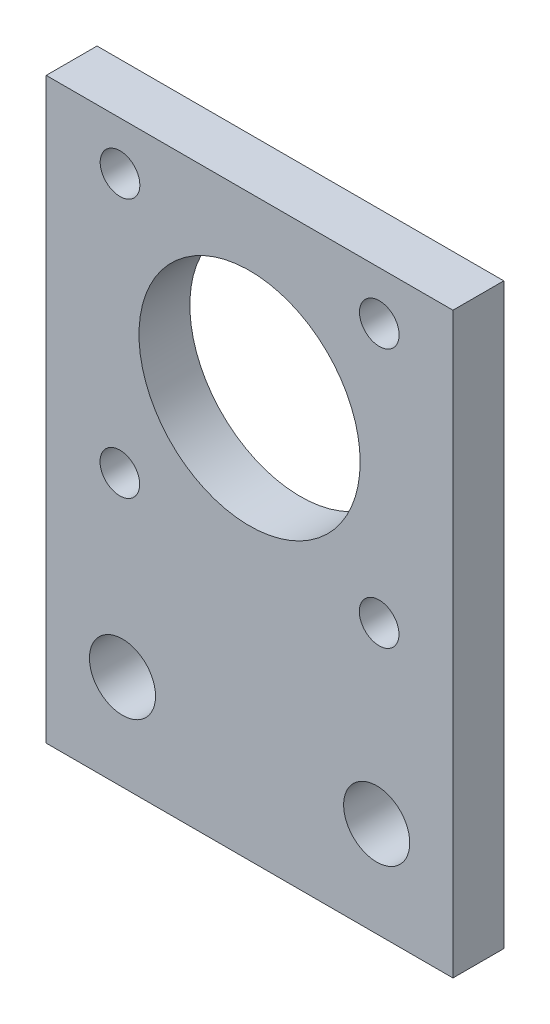
ISO-10303-21;
HEADER;
FILE_DESCRIPTION(('STEP AP214'),'2;1');
FILE_NAME('part.step','',(''),(''),'','','');
FILE_SCHEMA(('AUTOMOTIVE_DESIGN { 1 0 10303 214 1 1 1 1 }'));
ENDSEC;
DATA;
#1=APPLICATION_CONTEXT('core data for automotive mechanical design processes');
#2=APPLICATION_PROTOCOL_DEFINITION('international standard','automotive_design',2000,#1);
#3=PRODUCT_CONTEXT('',#1,'mechanical');
#4=PRODUCT('Part','Part','',(#3));
#5=PRODUCT_RELATED_PRODUCT_CATEGORY('part','',(#4));
#6=PRODUCT_DEFINITION_FORMATION('','',#4);
#7=PRODUCT_DEFINITION_CONTEXT('part definition',#1,'design');
#8=PRODUCT_DEFINITION('design','',#6,#7);
#9=PRODUCT_DEFINITION_SHAPE('','',#8);
#10=(LENGTH_UNIT() NAMED_UNIT(*) SI_UNIT(.MILLI.,.METRE.));
#11=(NAMED_UNIT(*) PLANE_ANGLE_UNIT() SI_UNIT($,.RADIAN.));
#12=(NAMED_UNIT(*) SI_UNIT($,.STERADIAN.) SOLID_ANGLE_UNIT());
#13=UNCERTAINTY_MEASURE_WITH_UNIT(LENGTH_MEASURE(1.E-05),#10,'distance_accuracy_value','');
#14=(GEOMETRIC_REPRESENTATION_CONTEXT(3) GLOBAL_UNCERTAINTY_ASSIGNED_CONTEXT((#13)) GLOBAL_UNIT_ASSIGNED_CONTEXT((#10,
#11,#12)) REPRESENTATION_CONTEXT('',''));
#15=CARTESIAN_POINT('',(0.,0.,0.));
#16=DIRECTION('',(0.,0.,1.));
#17=DIRECTION('',(1.,0.,0.));
#18=AXIS2_PLACEMENT_3D('',#15,#16,#17);
#19=CARTESIAN_POINT('',(25.7883827104955,0.,5.08));
#20=DIRECTION('',(1.,0.,0.));
#21=DIRECTION('',(0.,0.,-1.));
#22=AXIS2_PLACEMENT_3D('',#19,#20,#21);
#23=PLANE('',#22);
#24=DIRECTION('',(0.,-1.,0.));
#25=VECTOR('',#24,1.);
#26=CARTESIAN_POINT('',(25.7883827104955,0.,0.));
#27=LINE('',#26,#25);
#28=CARTESIAN_POINT('',(25.7883827104955,28.4998315016311,0.));
#29=VERTEX_POINT('',#28);
#30=CARTESIAN_POINT('',(25.7883827104955,-29.2851684983689,0.));
#31=VERTEX_POINT('',#30);
#32=EDGE_CURVE('E127',#29,#31,#27,.T.);
#33=ORIENTED_EDGE('',*,*,#32,.F.);
#34=DIRECTION('',(0.,0.,-1.));
#35=VECTOR('',#34,1.);
#36=CARTESIAN_POINT('',(25.7883827104955,28.4998315016311,5.08));
#37=LINE('',#36,#35);
#38=CARTESIAN_POINT('',(25.7883827104955,28.4998315016311,5.08));
#39=VERTEX_POINT('',#38);
#40=EDGE_CURVE('E11',#39,#29,#37,.T.);
#41=ORIENTED_EDGE('',*,*,#40,.F.);
#42=DIRECTION('',(0.,-1.,0.));
#43=VECTOR('',#42,1.);
#44=CARTESIAN_POINT('',(25.7883827104955,0.,5.08));
#45=LINE('',#44,#43);
#46=CARTESIAN_POINT('',(25.7883827104955,-29.2851684983689,5.08));
#47=VERTEX_POINT('',#46);
#48=EDGE_CURVE('E99',#39,#47,#45,.T.);
#49=ORIENTED_EDGE('',*,*,#48,.T.);
#50=DIRECTION('',(0.,0.,-1.));
#51=VECTOR('',#50,1.);
#52=CARTESIAN_POINT('',(25.7883827104955,-29.2851684983689,5.08));
#53=LINE('',#52,#51);
#54=EDGE_CURVE('E77',#47,#31,#53,.T.);
#55=ORIENTED_EDGE('',*,*,#54,.T.);
#56=EDGE_LOOP('',(#33,#41,#49,#55));
#57=FACE_BOUND('',#56,.T.);
#58=ADVANCED_FACE('F37',(#57),#23,.T.);
#59=CARTESIAN_POINT('',(0.,28.4998315016311,5.08));
#60=DIRECTION('',(0.,1.,0.));
#61=DIRECTION('',(0.,0.,1.));
#62=AXIS2_PLACEMENT_3D('',#59,#60,#61);
#63=PLANE('',#62);
#64=DIRECTION('',(1.,0.,0.));
#65=VECTOR('',#64,1.);
#66=CARTESIAN_POINT('',(0.,28.4998315016311,0.));
#67=LINE('',#66,#65);
#68=CARTESIAN_POINT('',(-14.8516172895046,28.4998315016311,0.));
#69=VERTEX_POINT('',#68);
#70=EDGE_CURVE('E89',#69,#29,#67,.T.);
#71=ORIENTED_EDGE('',*,*,#70,.F.);
#72=DIRECTION('',(0.,0.,-1.));
#73=VECTOR('',#72,1.);
#74=CARTESIAN_POINT('',(-14.8516172895046,28.4998315016311,5.08));
#75=LINE('',#74,#73);
#76=CARTESIAN_POINT('',(-14.8516172895046,28.4998315016311,5.08));
#77=VERTEX_POINT('',#76);
#78=EDGE_CURVE('E46',#77,#69,#75,.T.);
#79=ORIENTED_EDGE('',*,*,#78,.F.);
#80=DIRECTION('',(1.,0.,0.));
#81=VECTOR('',#80,1.);
#82=CARTESIAN_POINT('',(0.,28.4998315016311,5.08));
#83=LINE('',#82,#81);
#84=EDGE_CURVE('E87',#77,#39,#83,.T.);
#85=ORIENTED_EDGE('',*,*,#84,.T.);
#86=ORIENTED_EDGE('',*,*,#40,.T.);
#87=EDGE_LOOP('',(#71,#79,#85,#86));
#88=FACE_BOUND('',#87,.T.);
#89=ADVANCED_FACE('F85',(#88),#63,.T.);
#90=CARTESIAN_POINT('',(-14.8516172895046,0.,5.08));
#91=DIRECTION('',(1.,0.,0.));
#92=DIRECTION('',(0.,1.,0.));
#93=AXIS2_PLACEMENT_3D('',#90,#91,#92);
#94=PLANE('',#93);
#95=DIRECTION('',(0.,-1.,0.));
#96=VECTOR('',#95,1.);
#97=CARTESIAN_POINT('',(-14.8516172895046,0.,0.));
#98=LINE('',#97,#96);
#99=CARTESIAN_POINT('',(-14.8516172895045,-29.2851684983689,0.));
#100=VERTEX_POINT('',#99);
#101=EDGE_CURVE('E130',#69,#100,#98,.T.);
#102=ORIENTED_EDGE('',*,*,#101,.T.);
#103=DIRECTION('',(0.,0.,-1.));
#104=VECTOR('',#103,1.);
#105=CARTESIAN_POINT('',(-14.8516172895045,-29.2851684983689,5.08));
#106=LINE('',#105,#104);
#107=CARTESIAN_POINT('',(-14.8516172895045,-29.2851684983689,5.08));
#108=VERTEX_POINT('',#107);
#109=EDGE_CURVE('E92',#108,#100,#106,.T.);
#110=ORIENTED_EDGE('',*,*,#109,.F.);
#111=DIRECTION('',(0.,-1.,0.));
#112=VECTOR('',#111,1.);
#113=CARTESIAN_POINT('',(-14.8516172895046,0.,5.08));
#114=LINE('',#113,#112);
#115=EDGE_CURVE('E94',#77,#108,#114,.T.);
#116=ORIENTED_EDGE('',*,*,#115,.F.);
#117=ORIENTED_EDGE('',*,*,#78,.T.);
#118=EDGE_LOOP('',(#102,#110,#116,#117));
#119=FACE_BOUND('',#118,.T.);
#120=ADVANCED_FACE('F95',(#119),#94,.F.);
#121=CARTESIAN_POINT('',(18.4135838577593,-2.24296436487566,5.08));
#122=DIRECTION('',(0.,0.,-1.));
#123=DIRECTION('',(-1.,0.,0.));
#124=AXIS2_PLACEMENT_3D('',#121,#122,#123);
#125=CYLINDRICAL_SURFACE('',#124,1.9812);
#126=CARTESIAN_POINT('',(18.4135838577593,-2.24296436487566,5.08));
#127=DIRECTION('',(0.,0.,1.));
#128=DIRECTION('',(1.,0.,0.));
#129=AXIS2_PLACEMENT_3D('',#126,#127,#128);
#130=CIRCLE('',#129,1.9812);
#131=CARTESIAN_POINT('',(20.3947838577593,-2.24296436487566,5.08));
#132=VERTEX_POINT('',#131);
#133=EDGE_CURVE('E115',#132,#132,#130,.T.);
#134=ORIENTED_EDGE('',*,*,#133,.T.);
#135=EDGE_LOOP('',(#134));
#136=FACE_BOUND('',#135,.T.);
#137=CARTESIAN_POINT('',(18.4135838577593,-2.24296436487566,0.));
#138=DIRECTION('',(0.,0.,1.));
#139=DIRECTION('',(1.,0.,0.));
#140=AXIS2_PLACEMENT_3D('',#137,#138,#139);
#141=CIRCLE('',#140,1.9812);
#142=CARTESIAN_POINT('',(20.3947838577593,-2.24296436487566,0.));
#143=VERTEX_POINT('',#142);
#144=EDGE_CURVE('E142',#143,#143,#141,.T.);
#145=ORIENTED_EDGE('',*,*,#144,.F.);
#146=EDGE_LOOP('',(#145));
#147=FACE_BOUND('',#146,.T.);
#148=ADVANCED_FACE('F189',(#136,#147),#125,.F.);
#149=CARTESIAN_POINT('',(-7.49441614224074,-2.22536665534379,5.08));
#150=DIRECTION('',(0.,0.,-1.));
#151=DIRECTION('',(-1.,0.,0.));
#152=AXIS2_PLACEMENT_3D('',#149,#150,#151);
#153=CYLINDRICAL_SURFACE('',#152,1.9812);
#154=CARTESIAN_POINT('',(-7.49441614224074,-2.22536665534379,5.08));
#155=DIRECTION('',(0.,0.,1.));
#156=DIRECTION('',(1.,0.,0.));
#157=AXIS2_PLACEMENT_3D('',#154,#155,#156);
#158=CIRCLE('',#157,1.9812);
#159=CARTESIAN_POINT('',(-5.51321614224074,-2.22536665534379,5.08));
#160=VERTEX_POINT('',#159);
#161=EDGE_CURVE('E112',#160,#160,#158,.T.);
#162=ORIENTED_EDGE('',*,*,#161,.T.);
#163=EDGE_LOOP('',(#162));
#164=FACE_BOUND('',#163,.T.);
#165=CARTESIAN_POINT('',(-7.49441614224074,-2.22536665534379,0.));
#166=DIRECTION('',(0.,0.,1.));
#167=DIRECTION('',(1.,0.,0.));
#168=AXIS2_PLACEMENT_3D('',#165,#166,#167);
#169=CIRCLE('',#168,1.9812);
#170=CARTESIAN_POINT('',(-5.51321614224074,-2.22536665534379,0.));
#171=VERTEX_POINT('',#170);
#172=EDGE_CURVE('E139',#171,#171,#169,.T.);
#173=ORIENTED_EDGE('',*,*,#172,.F.);
#174=EDGE_LOOP('',(#173));
#175=FACE_BOUND('',#174,.T.);
#176=ADVANCED_FACE('F192',(#164,#175),#153,.F.);
#177=CARTESIAN_POINT('',(-7.47681843676835,23.6826273681379,5.08));
#178=DIRECTION('',(0.,0.,-1.));
#179=DIRECTION('',(-1.,0.,0.));
#180=AXIS2_PLACEMENT_3D('',#177,#178,#179);
#181=CYLINDRICAL_SURFACE('',#180,1.9812);
#182=CARTESIAN_POINT('',(-7.47681843676835,23.6826273681379,5.08));
#183=DIRECTION('',(0.,0.,1.));
#184=DIRECTION('',(1.,0.,0.));
#185=AXIS2_PLACEMENT_3D('',#182,#183,#184);
#186=CIRCLE('',#185,1.9812);
#187=CARTESIAN_POINT('',(-5.49561843676835,23.6826273681379,5.08));
#188=VERTEX_POINT('',#187);
#189=EDGE_CURVE('E109',#188,#188,#186,.T.);
#190=ORIENTED_EDGE('',*,*,#189,.T.);
#191=EDGE_LOOP('',(#190));
#192=FACE_BOUND('',#191,.T.);
#193=CARTESIAN_POINT('',(-7.47681843676835,23.6826273681379,0.));
#194=DIRECTION('',(0.,0.,1.));
#195=DIRECTION('',(1.,0.,0.));
#196=AXIS2_PLACEMENT_3D('',#193,#194,#195);
#197=CIRCLE('',#196,1.9812);
#198=CARTESIAN_POINT('',(-5.49561843676835,23.6826273681379,0.));
#199=VERTEX_POINT('',#198);
#200=EDGE_CURVE('E136',#199,#199,#197,.T.);
#201=ORIENTED_EDGE('',*,*,#200,.F.);
#202=EDGE_LOOP('',(#201));
#203=FACE_BOUND('',#202,.T.);
#204=ADVANCED_FACE('F196',(#192,#203),#181,.F.);
#205=CARTESIAN_POINT('',(18.4311815632316,23.665029658606,5.08));
#206=DIRECTION('',(0.,0.,-1.));
#207=DIRECTION('',(-1.,0.,0.));
#208=AXIS2_PLACEMENT_3D('',#205,#206,#207);
#209=CYLINDRICAL_SURFACE('',#208,1.9812);
#210=CARTESIAN_POINT('',(18.4311815632316,23.665029658606,5.08));
#211=DIRECTION('',(0.,0.,1.));
#212=DIRECTION('',(1.,0.,0.));
#213=AXIS2_PLACEMENT_3D('',#210,#211,#212);
#214=CIRCLE('',#213,1.9812);
#215=CARTESIAN_POINT('',(20.4123815632316,23.665029658606,5.08));
#216=VERTEX_POINT('',#215);
#217=EDGE_CURVE('E106',#216,#216,#214,.T.);
#218=ORIENTED_EDGE('',*,*,#217,.T.);
#219=EDGE_LOOP('',(#218));
#220=FACE_BOUND('',#219,.T.);
#221=CARTESIAN_POINT('',(18.4311815632316,23.665029658606,0.));
#222=DIRECTION('',(0.,0.,1.));
#223=DIRECTION('',(1.,0.,0.));
#224=AXIS2_PLACEMENT_3D('',#221,#222,#223);
#225=CIRCLE('',#224,1.9812);
#226=CARTESIAN_POINT('',(20.4123815632316,23.665029658606,0.));
#227=VERTEX_POINT('',#226);
#228=EDGE_CURVE('E133',#227,#227,#225,.T.);
#229=ORIENTED_EDGE('',*,*,#228,.F.);
#230=EDGE_LOOP('',(#229));
#231=FACE_BOUND('',#230,.T.);
#232=ADVANCED_FACE('F170',(#220,#231),#209,.F.);
#233=CARTESIAN_POINT('',(0.,-29.2851684983689,5.08));
#234=DIRECTION('',(0.,1.,0.));
#235=DIRECTION('',(0.,0.,1.));
#236=AXIS2_PLACEMENT_3D('',#233,#234,#235);
#237=PLANE('',#236);
#238=DIRECTION('',(1.,0.,0.));
#239=VECTOR('',#238,1.);
#240=CARTESIAN_POINT('',(0.,-29.2851684983689,0.));
#241=LINE('',#240,#239);
#242=EDGE_CURVE('E70',#100,#31,#241,.T.);
#243=ORIENTED_EDGE('',*,*,#242,.T.);
#244=ORIENTED_EDGE('',*,*,#54,.F.);
#245=DIRECTION('',(1.,0.,0.));
#246=VECTOR('',#245,1.);
#247=CARTESIAN_POINT('',(0.,-29.2851684983689,5.08));
#248=LINE('',#247,#246);
#249=EDGE_CURVE('E54',#108,#47,#248,.T.);
#250=ORIENTED_EDGE('',*,*,#249,.F.);
#251=ORIENTED_EDGE('',*,*,#109,.T.);
#252=EDGE_LOOP('',(#243,#244,#250,#251));
#253=FACE_BOUND('',#252,.T.);
#254=ADVANCED_FACE('F151',(#253),#237,.F.);
#255=CARTESIAN_POINT('',(18.1683827104955,-19.7601684983689,5.08));
#256=DIRECTION('',(0.,0.,-1.));
#257=DIRECTION('',(-1.,0.,0.));
#258=AXIS2_PLACEMENT_3D('',#255,#256,#257);
#259=CYLINDRICAL_SURFACE('',#258,3.302);
#260=CARTESIAN_POINT('',(18.1683827104955,-19.7601684983689,5.08));
#261=DIRECTION('',(0.,0.,1.));
#262=DIRECTION('',(1.,0.,0.));
#263=AXIS2_PLACEMENT_3D('',#260,#261,#262);
#264=CIRCLE('',#263,3.302);
#265=CARTESIAN_POINT('',(21.4703827104955,-19.7601684983689,5.08));
#266=VERTEX_POINT('',#265);
#267=EDGE_CURVE('E101',#266,#266,#264,.T.);
#268=ORIENTED_EDGE('',*,*,#267,.T.);
#269=EDGE_LOOP('',(#268));
#270=FACE_BOUND('',#269,.T.);
#271=CARTESIAN_POINT('',(18.1683827104955,-19.7601684983689,0.));
#272=DIRECTION('',(0.,0.,1.));
#273=DIRECTION('',(1.,0.,0.));
#274=AXIS2_PLACEMENT_3D('',#271,#272,#273);
#275=CIRCLE('',#274,3.302);
#276=CARTESIAN_POINT('',(21.4703827104955,-19.7601684983689,0.));
#277=VERTEX_POINT('',#276);
#278=EDGE_CURVE('E124',#277,#277,#275,.T.);
#279=ORIENTED_EDGE('',*,*,#278,.F.);
#280=EDGE_LOOP('',(#279));
#281=FACE_BOUND('',#280,.T.);
#282=ADVANCED_FACE('F161',(#270,#281),#259,.F.);
#283=CARTESIAN_POINT('',(-7.23161728950455,-19.7601684983689,5.08));
#284=DIRECTION('',(0.,0.,-1.));
#285=DIRECTION('',(-1.,0.,0.));
#286=AXIS2_PLACEMENT_3D('',#283,#284,#285);
#287=CYLINDRICAL_SURFACE('',#286,3.302);
#288=CARTESIAN_POINT('',(-7.23161728950455,-19.7601684983689,5.08));
#289=DIRECTION('',(0.,0.,1.));
#290=DIRECTION('',(1.,0.,0.));
#291=AXIS2_PLACEMENT_3D('',#288,#289,#290);
#292=CIRCLE('',#291,3.302);
#293=CARTESIAN_POINT('',(-3.92961728950455,-19.7601684983689,5.08));
#294=VERTEX_POINT('',#293);
#295=EDGE_CURVE('E148',#294,#294,#292,.T.);
#296=ORIENTED_EDGE('',*,*,#295,.T.);
#297=EDGE_LOOP('',(#296));
#298=FACE_BOUND('',#297,.T.);
#299=CARTESIAN_POINT('',(-7.23161728950455,-19.7601684983689,0.));
#300=DIRECTION('',(0.,0.,1.));
#301=DIRECTION('',(1.,0.,0.));
#302=AXIS2_PLACEMENT_3D('',#299,#300,#301);
#303=CIRCLE('',#302,3.302);
#304=CARTESIAN_POINT('',(-3.92961728950455,-19.7601684983689,0.));
#305=VERTEX_POINT('',#304);
#306=EDGE_CURVE('E121',#305,#305,#303,.T.);
#307=ORIENTED_EDGE('',*,*,#306,.F.);
#308=EDGE_LOOP('',(#307));
#309=FACE_BOUND('',#308,.T.);
#310=ADVANCED_FACE('F39',(#298,#309),#287,.F.);
#311=CARTESIAN_POINT('',(5.46838271049545,10.7198315016311,5.08));
#312=DIRECTION('',(0.,0.,-1.));
#313=DIRECTION('',(-1.,0.,0.));
#314=AXIS2_PLACEMENT_3D('',#311,#312,#313);
#315=CYLINDRICAL_SURFACE('',#314,11.049);
#316=CARTESIAN_POINT('',(5.46838271049545,10.7198315016311,5.08));
#317=DIRECTION('',(0.,0.,1.));
#318=DIRECTION('',(1.,0.,0.));
#319=AXIS2_PLACEMENT_3D('',#316,#317,#318);
#320=CIRCLE('',#319,11.049);
#321=CARTESIAN_POINT('',(16.5173827104955,10.7198315016311,5.08));
#322=VERTEX_POINT('',#321);
#323=EDGE_CURVE('E118',#322,#322,#320,.T.);
#324=ORIENTED_EDGE('',*,*,#323,.T.);
#325=EDGE_LOOP('',(#324));
#326=FACE_BOUND('',#325,.T.);
#327=CARTESIAN_POINT('',(5.46838271049545,10.7198315016311,0.));
#328=DIRECTION('',(0.,0.,1.));
#329=DIRECTION('',(1.,0.,0.));
#330=AXIS2_PLACEMENT_3D('',#327,#328,#329);
#331=CIRCLE('',#330,11.049);
#332=CARTESIAN_POINT('',(16.5173827104955,10.7198315016311,0.));
#333=VERTEX_POINT('',#332);
#334=EDGE_CURVE('E145',#333,#333,#331,.T.);
#335=ORIENTED_EDGE('',*,*,#334,.F.);
#336=EDGE_LOOP('',(#335));
#337=FACE_BOUND('',#336,.T.);
#338=ADVANCED_FACE('F168',(#326,#337),#315,.F.);
#339=CARTESIAN_POINT('',(0.,0.,5.08));
#340=DIRECTION('',(0.,0.,1.));
#341=DIRECTION('',(1.,0.,0.));
#342=AXIS2_PLACEMENT_3D('',#339,#340,#341);
#343=PLANE('',#342);
#344=ORIENTED_EDGE('',*,*,#295,.F.);
#345=EDGE_LOOP('',(#344));
#346=FACE_BOUND('',#345,.T.);
#347=ORIENTED_EDGE('',*,*,#267,.F.);
#348=EDGE_LOOP('',(#347));
#349=FACE_BOUND('',#348,.T.);
#350=ORIENTED_EDGE('',*,*,#48,.F.);
#351=ORIENTED_EDGE('',*,*,#84,.F.);
#352=ORIENTED_EDGE('',*,*,#115,.T.);
#353=ORIENTED_EDGE('',*,*,#249,.T.);
#354=EDGE_LOOP('',(#350,#351,#352,#353));
#355=FACE_BOUND('',#354,.T.);
#356=ORIENTED_EDGE('',*,*,#217,.F.);
#357=EDGE_LOOP('',(#356));
#358=FACE_BOUND('',#357,.T.);
#359=ORIENTED_EDGE('',*,*,#189,.F.);
#360=EDGE_LOOP('',(#359));
#361=FACE_BOUND('',#360,.T.);
#362=ORIENTED_EDGE('',*,*,#161,.F.);
#363=EDGE_LOOP('',(#362));
#364=FACE_BOUND('',#363,.T.);
#365=ORIENTED_EDGE('',*,*,#133,.F.);
#366=EDGE_LOOP('',(#365));
#367=FACE_BOUND('',#366,.T.);
#368=ORIENTED_EDGE('',*,*,#323,.F.);
#369=EDGE_LOOP('',(#368));
#370=FACE_BOUND('',#369,.T.);
#371=ADVANCED_FACE('F97',(#346,#349,#355,#358,#361,#364,#367,#370),#343,.T.);
#372=CARTESIAN_POINT('',(0.,0.,0.));
#373=DIRECTION('',(0.,0.,1.));
#374=DIRECTION('',(1.,0.,0.));
#375=AXIS2_PLACEMENT_3D('',#372,#373,#374);
#376=PLANE('',#375);
#377=ORIENTED_EDGE('',*,*,#306,.T.);
#378=EDGE_LOOP('',(#377));
#379=FACE_BOUND('',#378,.T.);
#380=ORIENTED_EDGE('',*,*,#278,.T.);
#381=EDGE_LOOP('',(#380));
#382=FACE_BOUND('',#381,.T.);
#383=ORIENTED_EDGE('',*,*,#32,.T.);
#384=ORIENTED_EDGE('',*,*,#242,.F.);
#385=ORIENTED_EDGE('',*,*,#101,.F.);
#386=ORIENTED_EDGE('',*,*,#70,.T.);
#387=EDGE_LOOP('',(#383,#384,#385,#386));
#388=FACE_BOUND('',#387,.T.);
#389=ORIENTED_EDGE('',*,*,#228,.T.);
#390=EDGE_LOOP('',(#389));
#391=FACE_BOUND('',#390,.T.);
#392=ORIENTED_EDGE('',*,*,#200,.T.);
#393=EDGE_LOOP('',(#392));
#394=FACE_BOUND('',#393,.T.);
#395=ORIENTED_EDGE('',*,*,#172,.T.);
#396=EDGE_LOOP('',(#395));
#397=FACE_BOUND('',#396,.T.);
#398=ORIENTED_EDGE('',*,*,#144,.T.);
#399=EDGE_LOOP('',(#398));
#400=FACE_BOUND('',#399,.T.);
#401=ORIENTED_EDGE('',*,*,#334,.T.);
#402=EDGE_LOOP('',(#401));
#403=FACE_BOUND('',#402,.T.);
#404=ADVANCED_FACE('F152',(#379,#382,#388,#391,#394,#397,#400,#403),#376,.F.);
#405=CLOSED_SHELL('',(#58,#89,#120,#148,#176,#204,#232,#254,#282,#310,#338,#371,#404));
#406=MANIFOLD_SOLID_BREP('B2',#405);
#407=ADVANCED_BREP_SHAPE_REPRESENTATION('',(#18,#406),#14);
#408=SHAPE_DEFINITION_REPRESENTATION(#9,#407);
ENDSEC;
END-ISO-10303-21;
